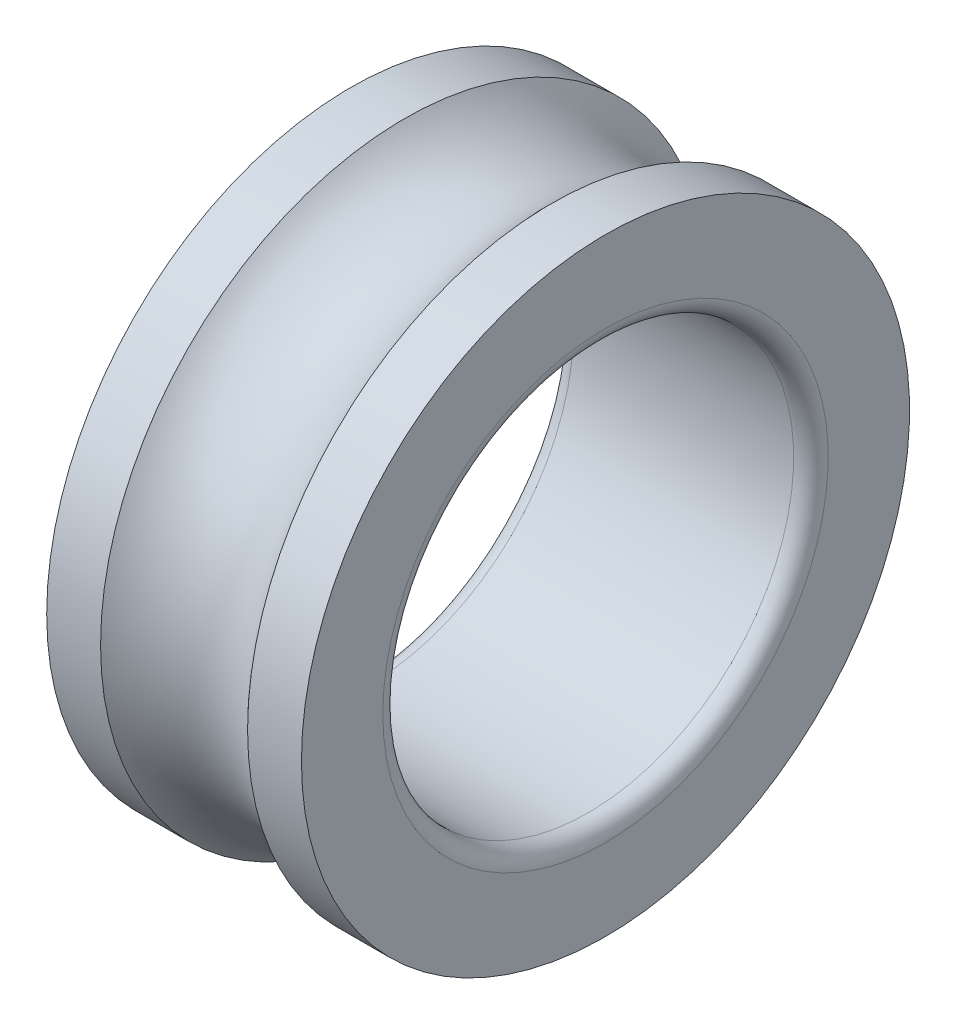
ISO-10303-21;
HEADER;
FILE_DESCRIPTION(('STEP AP214'),'2;1');
FILE_NAME('part.step','',(''),(''),'','','');
FILE_SCHEMA(('AUTOMOTIVE_DESIGN { 1 0 10303 214 1 1 1 1 }'));
ENDSEC;
DATA;
#1=APPLICATION_CONTEXT('core data for automotive mechanical design processes');
#2=APPLICATION_PROTOCOL_DEFINITION('international standard','automotive_design',2000,#1);
#3=PRODUCT_CONTEXT('',#1,'mechanical');
#4=PRODUCT('Part','Part','',(#3));
#5=PRODUCT_RELATED_PRODUCT_CATEGORY('part','',(#4));
#6=PRODUCT_DEFINITION_FORMATION('','',#4);
#7=PRODUCT_DEFINITION_CONTEXT('part definition',#1,'design');
#8=PRODUCT_DEFINITION('design','',#6,#7);
#9=PRODUCT_DEFINITION_SHAPE('','',#8);
#10=(LENGTH_UNIT() NAMED_UNIT(*) SI_UNIT(.MILLI.,.METRE.));
#11=(NAMED_UNIT(*) PLANE_ANGLE_UNIT() SI_UNIT($,.RADIAN.));
#12=(NAMED_UNIT(*) SI_UNIT($,.STERADIAN.) SOLID_ANGLE_UNIT());
#13=UNCERTAINTY_MEASURE_WITH_UNIT(LENGTH_MEASURE(1.E-05),#10,'distance_accuracy_value','');
#14=(GEOMETRIC_REPRESENTATION_CONTEXT(3) GLOBAL_UNCERTAINTY_ASSIGNED_CONTEXT((#13)) GLOBAL_UNIT_ASSIGNED_CONTEXT((#10,
#11,#12)) REPRESENTATION_CONTEXT('',''));
#15=CARTESIAN_POINT('',(0.,0.,0.));
#16=DIRECTION('',(0.,0.,1.));
#17=DIRECTION('',(1.,0.,0.));
#18=AXIS2_PLACEMENT_3D('',#15,#16,#17);
#19=CARTESIAN_POINT('',(-15.5,37.,0.));
#20=DIRECTION('',(1.,0.,0.));
#21=DIRECTION('',(0.,0.,-1.));
#22=AXIS2_PLACEMENT_3D('',#19,#20,#21);
#23=PLANE('',#22);
#24=CARTESIAN_POINT('',(-15.5,0.,0.));
#25=DIRECTION('',(-1.,0.,0.));
#26=DIRECTION('',(0.,0.,1.));
#27=AXIS2_PLACEMENT_3D('',#24,#25,#26);
#28=CIRCLE('',#27,27.1);
#29=CARTESIAN_POINT('',(-15.5,0.,27.1));
#30=VERTEX_POINT('',#29);
#31=EDGE_CURVE('E10',#30,#30,#28,.T.);
#32=ORIENTED_EDGE('',*,*,#31,.F.);
#33=EDGE_LOOP('',(#32));
#34=FACE_BOUND('',#33,.T.);
#35=CARTESIAN_POINT('',(-15.5,0.,0.));
#36=DIRECTION('',(-1.,0.,0.));
#37=DIRECTION('',(0.,0.,1.));
#38=AXIS2_PLACEMENT_3D('',#35,#36,#37);
#39=CIRCLE('',#38,37.);
#40=CARTESIAN_POINT('',(-15.5,0.,37.));
#41=VERTEX_POINT('',#40);
#42=EDGE_CURVE('E75',#41,#41,#39,.T.);
#43=ORIENTED_EDGE('',*,*,#42,.T.);
#44=EDGE_LOOP('',(#43));
#45=FACE_BOUND('',#44,.T.);
#46=ADVANCED_FACE('F38',(#34,#45),#23,.F.);
#47=CARTESIAN_POINT('',(-13.4,0.,0.));
#48=DIRECTION('',(-1.,0.,0.));
#49=DIRECTION('',(0.,0.,1.));
#50=AXIS2_PLACEMENT_3D('',#47,#48,#49);
#51=TOROIDAL_SURFACE('',#50,27.1,2.1);
#52=CARTESIAN_POINT('',(-13.4,0.,0.));
#53=DIRECTION('',(-1.,0.,0.));
#54=DIRECTION('',(0.,0.,1.));
#55=AXIS2_PLACEMENT_3D('',#52,#53,#54);
#56=CIRCLE('',#55,25.);
#57=CARTESIAN_POINT('',(-13.4,0.,25.));
#58=VERTEX_POINT('',#57);
#59=EDGE_CURVE('E45',#58,#58,#56,.T.);
#60=ORIENTED_EDGE('',*,*,#59,.F.);
#61=EDGE_LOOP('',(#60));
#62=FACE_BOUND('',#61,.T.);
#63=ORIENTED_EDGE('',*,*,#31,.T.);
#64=EDGE_LOOP('',(#63));
#65=FACE_BOUND('',#64,.T.);
#66=ADVANCED_FACE('F114',(#62,#65),#51,.T.);
#67=CARTESIAN_POINT('',(-62.7041409165547,0.,0.));
#68=DIRECTION('',(-1.,0.,0.));
#69=DIRECTION('',(0.,0.,1.));
#70=AXIS2_PLACEMENT_3D('',#67,#68,#69);
#71=CYLINDRICAL_SURFACE('',#70,25.);
#72=CARTESIAN_POINT('',(13.4,0.,0.));
#73=DIRECTION('',(-1.,0.,0.));
#74=DIRECTION('',(0.,0.,1.));
#75=AXIS2_PLACEMENT_3D('',#72,#73,#74);
#76=CIRCLE('',#75,25.);
#77=CARTESIAN_POINT('',(13.4,0.,25.));
#78=VERTEX_POINT('',#77);
#79=EDGE_CURVE('E51',#78,#78,#76,.T.);
#80=ORIENTED_EDGE('',*,*,#79,.F.);
#81=EDGE_LOOP('',(#80));
#82=FACE_BOUND('',#81,.T.);
#83=ORIENTED_EDGE('',*,*,#59,.T.);
#84=EDGE_LOOP('',(#83));
#85=FACE_BOUND('',#84,.T.);
#86=ADVANCED_FACE('F109',(#82,#85),#71,.F.);
#87=CARTESIAN_POINT('',(13.4,0.,0.));
#88=DIRECTION('',(-1.,0.,0.));
#89=DIRECTION('',(0.,0.,1.));
#90=AXIS2_PLACEMENT_3D('',#87,#88,#89);
#91=TOROIDAL_SURFACE('',#90,27.1,2.1);
#92=CARTESIAN_POINT('',(15.5,0.,0.));
#93=DIRECTION('',(-1.,0.,0.));
#94=DIRECTION('',(0.,0.,1.));
#95=AXIS2_PLACEMENT_3D('',#92,#93,#94);
#96=CIRCLE('',#95,27.1);
#97=CARTESIAN_POINT('',(15.5,0.,27.1));
#98=VERTEX_POINT('',#97);
#99=EDGE_CURVE('E57',#98,#98,#96,.T.);
#100=ORIENTED_EDGE('',*,*,#99,.F.);
#101=EDGE_LOOP('',(#100));
#102=FACE_BOUND('',#101,.T.);
#103=ORIENTED_EDGE('',*,*,#79,.T.);
#104=EDGE_LOOP('',(#103));
#105=FACE_BOUND('',#104,.T.);
#106=ADVANCED_FACE('F103',(#102,#105),#91,.T.);
#107=CARTESIAN_POINT('',(15.5,37.,0.));
#108=DIRECTION('',(-1.,0.,0.));
#109=DIRECTION('',(0.,0.,1.));
#110=AXIS2_PLACEMENT_3D('',#107,#108,#109);
#111=PLANE('',#110);
#112=CARTESIAN_POINT('',(15.5,0.,0.));
#113=DIRECTION('',(-1.,0.,0.));
#114=DIRECTION('',(0.,0.,1.));
#115=AXIS2_PLACEMENT_3D('',#112,#113,#114);
#116=CIRCLE('',#115,37.);
#117=CARTESIAN_POINT('',(15.5,0.,37.));
#118=VERTEX_POINT('',#117);
#119=EDGE_CURVE('E63',#118,#118,#116,.T.);
#120=ORIENTED_EDGE('',*,*,#119,.F.);
#121=EDGE_LOOP('',(#120));
#122=FACE_BOUND('',#121,.T.);
#123=ORIENTED_EDGE('',*,*,#99,.T.);
#124=EDGE_LOOP('',(#123));
#125=FACE_BOUND('',#124,.T.);
#126=ADVANCED_FACE('F97',(#122,#125),#111,.F.);
#127=CARTESIAN_POINT('',(-62.7041409165547,0.,0.));
#128=DIRECTION('',(-1.,0.,0.));
#129=DIRECTION('',(0.,0.,1.));
#130=AXIS2_PLACEMENT_3D('',#127,#128,#129);
#131=CYLINDRICAL_SURFACE('',#130,37.);
#132=CARTESIAN_POINT('',(8.94427190999913,0.,0.));
#133=DIRECTION('',(-1.,0.,0.));
#134=DIRECTION('',(0.,0.,1.));
#135=AXIS2_PLACEMENT_3D('',#132,#133,#134);
#136=CIRCLE('',#135,37.);
#137=CARTESIAN_POINT('',(8.94427190999913,0.,37.));
#138=VERTEX_POINT('',#137);
#139=EDGE_CURVE('E67',#138,#138,#136,.T.);
#140=ORIENTED_EDGE('',*,*,#139,.F.);
#141=EDGE_LOOP('',(#140));
#142=FACE_BOUND('',#141,.T.);
#143=ORIENTED_EDGE('',*,*,#119,.T.);
#144=EDGE_LOOP('',(#143));
#145=FACE_BOUND('',#144,.T.);
#146=ADVANCED_FACE('F91',(#142,#145),#131,.T.);
#147=CARTESIAN_POINT('',(0.,0.,0.));
#148=DIRECTION('',(-1.,0.,0.));
#149=DIRECTION('',(0.,0.,1.));
#150=AXIS2_PLACEMENT_3D('',#147,#148,#149);
#151=TOROIDAL_SURFACE('',#150,45.,12.);
#152=CARTESIAN_POINT('',(-8.94427190999913,0.,0.));
#153=DIRECTION('',(-1.,0.,0.));
#154=DIRECTION('',(0.,0.,1.));
#155=AXIS2_PLACEMENT_3D('',#152,#153,#154);
#156=CIRCLE('',#155,37.);
#157=CARTESIAN_POINT('',(-8.94427190999913,0.,37.));
#158=VERTEX_POINT('',#157);
#159=EDGE_CURVE('E71',#158,#158,#156,.T.);
#160=ORIENTED_EDGE('',*,*,#159,.F.);
#161=EDGE_LOOP('',(#160));
#162=FACE_BOUND('',#161,.T.);
#163=ORIENTED_EDGE('',*,*,#139,.T.);
#164=EDGE_LOOP('',(#163));
#165=FACE_BOUND('',#164,.T.);
#166=ADVANCED_FACE('F85',(#162,#165),#151,.F.);
#167=CARTESIAN_POINT('',(-62.7041409165547,0.,0.));
#168=DIRECTION('',(-1.,0.,0.));
#169=DIRECTION('',(0.,0.,1.));
#170=AXIS2_PLACEMENT_3D('',#167,#168,#169);
#171=CYLINDRICAL_SURFACE('',#170,37.);
#172=ORIENTED_EDGE('',*,*,#42,.F.);
#173=EDGE_LOOP('',(#172));
#174=FACE_BOUND('',#173,.T.);
#175=ORIENTED_EDGE('',*,*,#159,.T.);
#176=EDGE_LOOP('',(#175));
#177=FACE_BOUND('',#176,.T.);
#178=ADVANCED_FACE('F82',(#174,#177),#171,.T.);
#179=CLOSED_SHELL('',(#46,#66,#86,#106,#126,#146,#166,#178));
#180=MANIFOLD_SOLID_BREP('B2',#179);
#181=ADVANCED_BREP_SHAPE_REPRESENTATION('',(#18,#180),#14);
#182=SHAPE_DEFINITION_REPRESENTATION(#9,#181);
ENDSEC;
END-ISO-10303-21;
